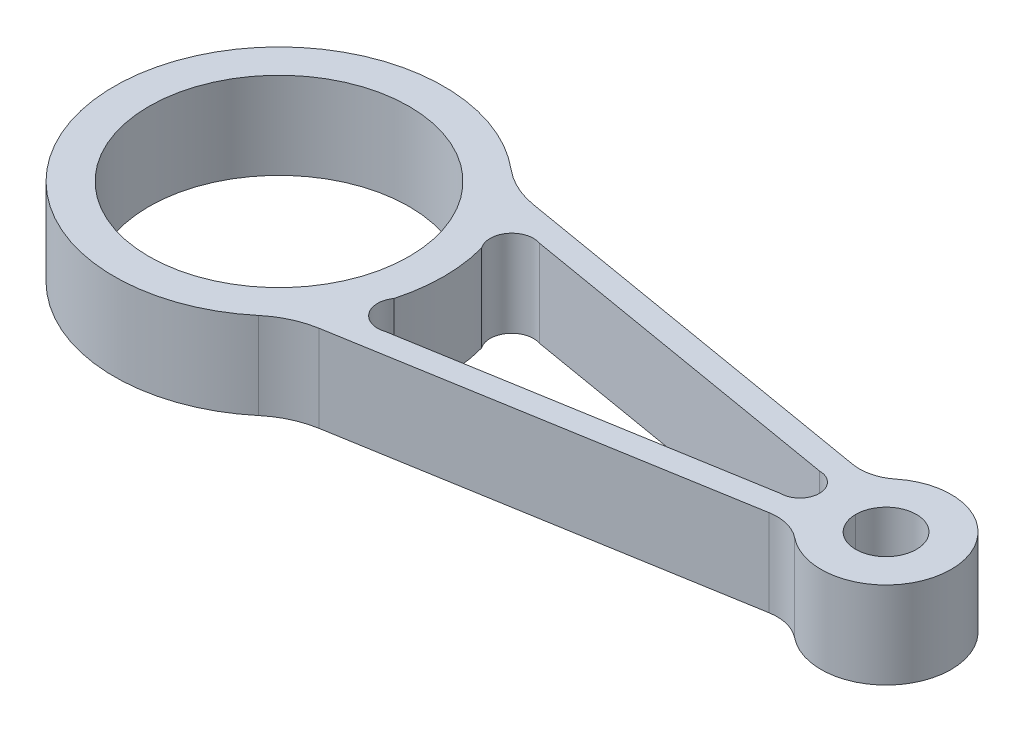
ISO-10303-21;
HEADER;
FILE_DESCRIPTION(('STEP AP214'),'2;1');
FILE_NAME('part.step','',(''),(''),'','','');
FILE_SCHEMA(('AUTOMOTIVE_DESIGN { 1 0 10303 214 1 1 1 1 }'));
ENDSEC;
DATA;
#1=APPLICATION_CONTEXT('core data for automotive mechanical design processes');
#2=APPLICATION_PROTOCOL_DEFINITION('international standard','automotive_design',2000,#1);
#3=PRODUCT_CONTEXT('',#1,'mechanical');
#4=PRODUCT('Part','Part','',(#3));
#5=PRODUCT_RELATED_PRODUCT_CATEGORY('part','',(#4));
#6=PRODUCT_DEFINITION_FORMATION('','',#4);
#7=PRODUCT_DEFINITION_CONTEXT('part definition',#1,'design');
#8=PRODUCT_DEFINITION('design','',#6,#7);
#9=PRODUCT_DEFINITION_SHAPE('','',#8);
#10=(LENGTH_UNIT() NAMED_UNIT(*) SI_UNIT(.MILLI.,.METRE.));
#11=(NAMED_UNIT(*) PLANE_ANGLE_UNIT() SI_UNIT($,.RADIAN.));
#12=(NAMED_UNIT(*) SI_UNIT($,.STERADIAN.) SOLID_ANGLE_UNIT());
#13=UNCERTAINTY_MEASURE_WITH_UNIT(LENGTH_MEASURE(1.E-05),#10,'distance_accuracy_value','');
#14=(GEOMETRIC_REPRESENTATION_CONTEXT(3) GLOBAL_UNCERTAINTY_ASSIGNED_CONTEXT((#13)) GLOBAL_UNIT_ASSIGNED_CONTEXT((#10,
#11,#12)) REPRESENTATION_CONTEXT('',''));
#15=CARTESIAN_POINT('',(0.,0.,0.));
#16=DIRECTION('',(0.,0.,1.));
#17=DIRECTION('',(1.,0.,0.));
#18=AXIS2_PLACEMENT_3D('',#15,#16,#17);
#19=CARTESIAN_POINT('',(21.2496463802184,10.,-4.8836400556848));
#20=DIRECTION('',(0.,-1.,0.));
#21=DIRECTION('',(0.,0.,-1.));
#22=AXIS2_PLACEMENT_3D('',#19,#20,#21);
#23=CYLINDRICAL_SURFACE('',#22,7.);
#24=CARTESIAN_POINT('',(21.2496463802184,10.,-4.8836400556848));
#25=DIRECTION('',(0.,1.,0.));
#26=DIRECTION('',(0.,0.,1.));
#27=AXIS2_PLACEMENT_3D('',#24,#25,#26);
#28=CIRCLE('',#27,7.);
#29=CARTESIAN_POINT('',(28.2496463802184,10.,-4.8836400556848));
#30=VERTEX_POINT('',#29);
#31=CARTESIAN_POINT('',(14.2496463802184,10.,-4.8836400556848));
#32=VERTEX_POINT('',#31);
#33=EDGE_CURVE('E216',#30,#32,#28,.T.);
#34=ORIENTED_EDGE('',*,*,#33,.T.);
#35=DIRECTION('',(0.,-1.,0.));
#36=VECTOR('',#35,1.);
#37=CARTESIAN_POINT('',(14.2496463802184,10.,-4.8836400556848));
#38=LINE('',#37,#36);
#39=CARTESIAN_POINT('',(14.2496463802184,-10.,-4.8836400556848));
#40=VERTEX_POINT('',#39);
#41=EDGE_CURVE('E11',#32,#40,#38,.T.);
#42=ORIENTED_EDGE('',*,*,#41,.T.);
#43=CARTESIAN_POINT('',(21.2496463802184,-10.,-4.8836400556848));
#44=DIRECTION('',(0.,1.,0.));
#45=DIRECTION('',(0.,0.,1.));
#46=AXIS2_PLACEMENT_3D('',#43,#44,#45);
#47=CIRCLE('',#46,7.);
#48=CARTESIAN_POINT('',(28.2496463802184,-10.,-4.8836400556848));
#49=VERTEX_POINT('',#48);
#50=EDGE_CURVE('E233',#49,#40,#47,.T.);
#51=ORIENTED_EDGE('',*,*,#50,.F.);
#52=DIRECTION('',(0.,1.,0.));
#53=VECTOR('',#52,1.);
#54=CARTESIAN_POINT('',(28.2496463802184,10.,-4.8836400556848));
#55=LINE('',#54,#53);
#56=EDGE_CURVE('E54',#49,#30,#55,.T.);
#57=ORIENTED_EDGE('',*,*,#56,.T.);
#58=EDGE_LOOP('',(#34,#42,#51,#57));
#59=FACE_BOUND('',#58,.T.);
#60=ADVANCED_FACE('F45',(#59),#23,.F.);
#61=CARTESIAN_POINT('',(2.50703369561259,10.,-14.7699727366896));
#62=DIRECTION('',(0.167344961591018,0.,-0.985898404416044));
#63=DIRECTION('',(-0.985898404416044,0.,-0.167344961591018));
#64=AXIS2_PLACEMENT_3D('',#61,#62,#63);
#65=PLANE('',#64);
#66=DIRECTION('',(0.985898404416044,0.,0.167344961591018));
#67=VECTOR('',#66,1.);
#68=CARTESIAN_POINT('',(2.50703369561259,-10.,-14.7699727366896));
#69=LINE('',#68,#67);
#70=CARTESIAN_POINT('',(-84.8092010521242,-10.,-29.5909034580322));
#71=VERTEX_POINT('',#70);
#72=CARTESIAN_POINT('',(3.93530449082066,-10.,-14.5275401287302));
#73=VERTEX_POINT('',#72);
#74=EDGE_CURVE('E236',#71,#73,#69,.T.);
#75=ORIENTED_EDGE('',*,*,#74,.F.);
#76=DIRECTION('',(0.,-1.,0.));
#77=VECTOR('',#76,1.);
#78=CARTESIAN_POINT('',(-84.8092010521243,10.,-29.5909034580322));
#79=LINE('',#78,#77);
#80=CARTESIAN_POINT('',(-84.8092010521242,10.,-29.5909034580322));
#81=VERTEX_POINT('',#80);
#82=EDGE_CURVE('E274',#71,#81,#79,.F.);
#83=ORIENTED_EDGE('',*,*,#82,.T.);
#84=DIRECTION('',(0.985898404416044,0.,0.167344961591018));
#85=VECTOR('',#84,1.);
#86=CARTESIAN_POINT('',(2.50703369561259,10.,-14.7699727366896));
#87=LINE('',#86,#85);
#88=CARTESIAN_POINT('',(3.93530449082066,10.,-14.5275401287302));
#89=VERTEX_POINT('',#88);
#90=EDGE_CURVE('E218',#81,#89,#87,.T.);
#91=ORIENTED_EDGE('',*,*,#90,.T.);
#92=DIRECTION('',(0.,-1.,0.));
#93=VECTOR('',#92,1.);
#94=CARTESIAN_POINT('',(3.93530449082067,10.,-14.5275401287302));
#95=LINE('',#94,#93);
#96=EDGE_CURVE('E256',#89,#73,#95,.T.);
#97=ORIENTED_EDGE('',*,*,#96,.T.);
#98=EDGE_LOOP('',(#75,#83,#91,#97));
#99=FACE_BOUND('',#98,.T.);
#100=ADVANCED_FACE('F312',(#99),#65,.T.);
#101=CARTESIAN_POINT('',(-118.750353619782,10.,-4.8836400556848));
#102=DIRECTION('',(0.,-1.,0.));
#103=DIRECTION('',(0.,0.,-1.));
#104=AXIS2_PLACEMENT_3D('',#101,#102,#103);
#105=CYLINDRICAL_SURFACE('',#104,38.);
#106=CARTESIAN_POINT('',(-118.750353619782,10.,-4.8836400556848));
#107=DIRECTION('',(0.,1.,0.));
#108=DIRECTION('',(0.,0.,1.));
#109=AXIS2_PLACEMENT_3D('',#106,#107,#108);
#110=CIRCLE('',#109,38.);
#111=CARTESIAN_POINT('',(-94.3202507166755,10.,-33.9898262047433));
#112=VERTEX_POINT('',#111);
#113=CARTESIAN_POINT('',(-94.3202507166755,10.,24.2225460933737));
#114=VERTEX_POINT('',#113);
#115=EDGE_CURVE('E221',#112,#114,#110,.T.);
#116=ORIENTED_EDGE('',*,*,#115,.F.);
#117=DIRECTION('',(0.,-1.,0.));
#118=VECTOR('',#117,1.);
#119=CARTESIAN_POINT('',(-94.3202507166755,10.,-33.9898262047433));
#120=LINE('',#119,#118);
#121=CARTESIAN_POINT('',(-94.3202507166755,-10.,-33.9898262047433));
#122=VERTEX_POINT('',#121);
#123=EDGE_CURVE('E271',#112,#122,#120,.T.);
#124=ORIENTED_EDGE('',*,*,#123,.T.);
#125=CARTESIAN_POINT('',(-118.750353619782,-10.,-4.8836400556848));
#126=DIRECTION('',(0.,1.,0.));
#127=DIRECTION('',(0.,0.,1.));
#128=AXIS2_PLACEMENT_3D('',#125,#126,#127);
#129=CIRCLE('',#128,38.);
#130=CARTESIAN_POINT('',(-94.3202507166755,-10.,24.2225460933737));
#131=VERTEX_POINT('',#130);
#132=EDGE_CURVE('E238',#122,#131,#129,.T.);
#133=ORIENTED_EDGE('',*,*,#132,.T.);
#134=DIRECTION('',(0.,-1.,0.));
#135=VECTOR('',#134,1.);
#136=CARTESIAN_POINT('',(-94.3202507166755,10.,24.2225460933737));
#137=LINE('',#136,#135);
#138=EDGE_CURVE('E269',#131,#114,#137,.F.);
#139=ORIENTED_EDGE('',*,*,#138,.T.);
#140=EDGE_LOOP('',(#116,#124,#133,#139));
#141=FACE_BOUND('',#140,.T.);
#142=ADVANCED_FACE('F316',(#141),#105,.T.);
#143=CARTESIAN_POINT('',(0.895577710639579,10.,5.27621882102439));
#144=DIRECTION('',(-0.167344961591018,0.,-0.985898404416044));
#145=DIRECTION('',(-0.985898404416044,0.,0.167344961591018));
#146=AXIS2_PLACEMENT_3D('',#143,#144,#145);
#147=PLANE('',#146);
#148=DIRECTION('',(0.985898404416044,0.,-0.167344961591018));
#149=VECTOR('',#148,1.);
#150=CARTESIAN_POINT('',(0.895577710639579,10.,5.27621882102439));
#151=LINE('',#150,#149);
#152=CARTESIAN_POINT('',(-84.8092010521242,10.,19.8236233466626));
#153=VERTEX_POINT('',#152);
#154=CARTESIAN_POINT('',(3.93530449082067,10.,4.76026001736055));
#155=VERTEX_POINT('',#154);
#156=EDGE_CURVE('E224',#153,#155,#151,.T.);
#157=ORIENTED_EDGE('',*,*,#156,.F.);
#158=DIRECTION('',(0.,1.,0.));
#159=VECTOR('',#158,1.);
#160=CARTESIAN_POINT('',(-84.8092010521242,-10.,19.8236233466626));
#161=LINE('',#160,#159);
#162=CARTESIAN_POINT('',(-84.8092010521242,-10.,19.8236233466626));
#163=VERTEX_POINT('',#162);
#164=EDGE_CURVE('E276',#153,#163,#161,.F.);
#165=ORIENTED_EDGE('',*,*,#164,.T.);
#166=DIRECTION('',(0.985898404416044,0.,-0.167344961591018));
#167=VECTOR('',#166,1.);
#168=CARTESIAN_POINT('',(0.895577710639579,-10.,5.27621882102439));
#169=LINE('',#168,#167);
#170=CARTESIAN_POINT('',(3.93530449082067,-10.,4.76026001736055));
#171=VERTEX_POINT('',#170);
#172=EDGE_CURVE('E241',#163,#171,#169,.T.);
#173=ORIENTED_EDGE('',*,*,#172,.T.);
#174=DIRECTION('',(0.,1.,0.));
#175=VECTOR('',#174,1.);
#176=CARTESIAN_POINT('',(3.93530449082067,10.,4.76026001736055));
#177=LINE('',#176,#175);
#178=EDGE_CURVE('E253',#171,#155,#177,.T.);
#179=ORIENTED_EDGE('',*,*,#178,.T.);
#180=EDGE_LOOP('',(#157,#165,#173,#179));
#181=FACE_BOUND('',#180,.T.);
#182=ADVANCED_FACE('F306',(#181),#147,.F.);
#183=CARTESIAN_POINT('',(21.2496463802184,10.,-4.8836400556848));
#184=DIRECTION('',(0.,-1.,0.));
#185=DIRECTION('',(0.,0.,-1.));
#186=AXIS2_PLACEMENT_3D('',#183,#184,#185);
#187=CYLINDRICAL_SURFACE('',#186,15.);
#188=CARTESIAN_POINT('',(21.2496463802184,10.,-4.8836400556848));
#189=DIRECTION('',(0.,1.,0.));
#190=DIRECTION('',(0.,0.,1.));
#191=AXIS2_PLACEMENT_3D('',#188,#189,#190);
#192=CIRCLE('',#191,15.);
#193=CARTESIAN_POINT('',(11.8651110161259,10.,6.81809041463867));
#194=VERTEX_POINT('',#193);
#195=CARTESIAN_POINT('',(11.8651110161259,10.,-16.5853705260083));
#196=VERTEX_POINT('',#195);
#197=EDGE_CURVE('E226',#194,#196,#192,.T.);
#198=ORIENTED_EDGE('',*,*,#197,.F.);
#199=DIRECTION('',(0.,-1.,0.));
#200=VECTOR('',#199,1.);
#201=CARTESIAN_POINT('',(11.8651110161259,10.,6.81809041463867));
#202=LINE('',#201,#200);
#203=CARTESIAN_POINT('',(11.8651110161259,-10.,6.81809041463867));
#204=VERTEX_POINT('',#203);
#205=EDGE_CURVE('E250',#194,#204,#202,.T.);
#206=ORIENTED_EDGE('',*,*,#205,.T.);
#207=CARTESIAN_POINT('',(21.2496463802184,-10.,-4.8836400556848));
#208=DIRECTION('',(0.,1.,0.));
#209=DIRECTION('',(0.,0.,1.));
#210=AXIS2_PLACEMENT_3D('',#207,#208,#209);
#211=CIRCLE('',#210,15.);
#212=CARTESIAN_POINT('',(11.8651110161259,-10.,-16.5853705260083));
#213=VERTEX_POINT('',#212);
#214=EDGE_CURVE('E243',#204,#213,#211,.T.);
#215=ORIENTED_EDGE('',*,*,#214,.T.);
#216=DIRECTION('',(0.,-1.,0.));
#217=VECTOR('',#216,1.);
#218=CARTESIAN_POINT('',(11.8651110161259,10.,-16.5853705260083));
#219=LINE('',#218,#217);
#220=EDGE_CURVE('E232',#213,#196,#219,.F.);
#221=ORIENTED_EDGE('',*,*,#220,.T.);
#222=EDGE_LOOP('',(#198,#206,#215,#221));
#223=FACE_BOUND('',#222,.T.);
#224=ADVANCED_FACE('F298',(#223),#187,.T.);
#225=ORIENTED_EDGE('',*,*,#41,.F.);
#226=EDGE_CURVE('E219',#32,#30,#28,.T.);
#227=ORIENTED_EDGE('',*,*,#226,.T.);
#228=ORIENTED_EDGE('',*,*,#56,.F.);
#229=EDGE_CURVE('E208',#40,#49,#47,.T.);
#230=ORIENTED_EDGE('',*,*,#229,.F.);
#231=EDGE_LOOP('',(#225,#227,#228,#230));
#232=FACE_BOUND('',#231,.T.);
#233=ADVANCED_FACE('F295',(#232),#23,.F.);
#234=CARTESIAN_POINT('',(-118.750353619782,10.,-4.8836400556848));
#235=DIRECTION('',(0.,-1.,0.));
#236=DIRECTION('',(0.,0.,-1.));
#237=AXIS2_PLACEMENT_3D('',#234,#235,#236);
#238=CYLINDRICAL_SURFACE('',#237,30.);
#239=CARTESIAN_POINT('',(-118.750353619782,10.,-4.8836400556848));
#240=DIRECTION('',(0.,1.,0.));
#241=DIRECTION('',(0.,0.,1.));
#242=AXIS2_PLACEMENT_3D('',#239,#240,#241);
#243=CIRCLE('',#242,30.);
#244=CARTESIAN_POINT('',(-118.750353619782,10.,25.1163599443152));
#245=VERTEX_POINT('',#244);
#246=EDGE_CURVE('E229',#245,#245,#243,.T.);
#247=ORIENTED_EDGE('',*,*,#246,.T.);
#248=EDGE_LOOP('',(#247));
#249=FACE_BOUND('',#248,.T.);
#250=CARTESIAN_POINT('',(-118.750353619782,-10.,-4.8836400556848));
#251=DIRECTION('',(0.,1.,0.));
#252=DIRECTION('',(0.,0.,1.));
#253=AXIS2_PLACEMENT_3D('',#250,#251,#252);
#254=CIRCLE('',#253,30.);
#255=CARTESIAN_POINT('',(-118.750353619782,-10.,25.1163599443152));
#256=VERTEX_POINT('',#255);
#257=EDGE_CURVE('E246',#256,#256,#254,.T.);
#258=ORIENTED_EDGE('',*,*,#257,.F.);
#259=EDGE_LOOP('',(#258));
#260=FACE_BOUND('',#259,.T.);
#261=ADVANCED_FACE('F297',(#249,#260),#238,.F.);
#262=CARTESIAN_POINT('',(0.,10.,0.));
#263=DIRECTION('',(0.,1.,0.));
#264=DIRECTION('',(0.,0.,1.));
#265=AXIS2_PLACEMENT_3D('',#262,#263,#264);
#266=PLANE('',#265);
#267=CARTESIAN_POINT('',(1.37390603918051,10.,-4.8836400556848));
#268=DIRECTION('',(0.,1.,0.));
#269=DIRECTION('',(0.,0.,1.));
#270=AXIS2_PLACEMENT_3D('',#267,#268,#269);
#271=CIRCLE('',#270,4.5);
#272=CARTESIAN_POINT('',(1.37390603918051,10.,-0.3836400556848));
#273=VERTEX_POINT('',#272);
#274=CARTESIAN_POINT('',(1.37390603918051,10.,-9.3836400556848));
#275=VERTEX_POINT('',#274);
#276=EDGE_CURVE('E163',#273,#275,#271,.T.);
#277=ORIENTED_EDGE('',*,*,#276,.F.);
#278=DIRECTION('',(0.985898404416043,0.,-0.167344961591018));
#279=VECTOR('',#278,1.);
#280=CARTESIAN_POINT('',(-76.3856633438721,10.,12.8151561828065));
#281=LINE('',#280,#279);
#282=CARTESIAN_POINT('',(-76.3856633438721,10.,12.8151561828065));
#283=VERTEX_POINT('',#282);
#284=EDGE_CURVE('E182',#283,#273,#281,.T.);
#285=ORIENTED_EDGE('',*,*,#284,.F.);
#286=CARTESIAN_POINT('',(-78.0355146500686,10.,8.0951995445055));
#287=DIRECTION('',(0.,1.,0.));
#288=DIRECTION('',(0.,0.,1.));
#289=AXIS2_PLACEMENT_3D('',#286,#287,#288);
#290=CIRCLE('',#289,4.99999999999999);
#291=CARTESIAN_POINT('',(-82.1130798779666,10.,5.20150608937991));
#292=VERTEX_POINT('',#291);
#293=EDGE_CURVE('E185',#292,#283,#290,.T.);
#294=ORIENTED_EDGE('',*,*,#293,.F.);
#295=CARTESIAN_POINT('',(-118.750353619782,10.,-4.8836400556848));
#296=DIRECTION('',(0.,-1.,0.));
#297=DIRECTION('',(0.,0.,1.));
#298=AXIS2_PLACEMENT_3D('',#295,#296,#297);
#299=CIRCLE('',#298,38.);
#300=CARTESIAN_POINT('',(-82.1130798779666,10.,-14.9687862007495));
#301=VERTEX_POINT('',#300);
#302=EDGE_CURVE('E201',#301,#292,#299,.T.);
#303=ORIENTED_EDGE('',*,*,#302,.F.);
#304=CARTESIAN_POINT('',(-78.0355146500686,10.,-17.8624796558751));
#305=DIRECTION('',(0.,1.,0.));
#306=DIRECTION('',(0.,0.,1.));
#307=AXIS2_PLACEMENT_3D('',#304,#305,#306);
#308=CIRCLE('',#307,4.99999999999999);
#309=CARTESIAN_POINT('',(-76.3856633438721,10.,-22.5824362941761));
#310=VERTEX_POINT('',#309);
#311=EDGE_CURVE('E198',#310,#301,#308,.T.);
#312=ORIENTED_EDGE('',*,*,#311,.F.);
#313=DIRECTION('',(-0.985898404416043,0.,-0.167344961591018));
#314=VECTOR('',#313,1.);
#315=CARTESIAN_POINT('',(-76.3856633438721,10.,-22.5824362941761));
#316=LINE('',#315,#314);
#317=EDGE_CURVE('E196',#275,#310,#316,.T.);
#318=ORIENTED_EDGE('',*,*,#317,.F.);
#319=EDGE_LOOP('',(#277,#285,#294,#303,#312,#318));
#320=FACE_BOUND('',#319,.T.);
#321=ORIENTED_EDGE('',*,*,#33,.F.);
#322=ORIENTED_EDGE('',*,*,#226,.F.);
#323=EDGE_LOOP('',(#321,#322));
#324=FACE_BOUND('',#323,.T.);
#325=ORIENTED_EDGE('',*,*,#90,.F.);
#326=CARTESIAN_POINT('',(-81.4623018203039,10.,-49.3088715463531));
#327=DIRECTION('',(0.,1.,0.));
#328=DIRECTION('',(0.,0.,1.));
#329=AXIS2_PLACEMENT_3D('',#326,#327,#328);
#330=CIRCLE('',#329,20.);
#331=EDGE_CURVE('E281',#81,#112,#330,.F.);
#332=ORIENTED_EDGE('',*,*,#331,.T.);
#333=ORIENTED_EDGE('',*,*,#115,.T.);
#334=CARTESIAN_POINT('',(-81.4623018203039,10.,39.5415914349835));
#335=DIRECTION('',(0.,1.,0.));
#336=DIRECTION('',(0.,0.,1.));
#337=AXIS2_PLACEMENT_3D('',#334,#335,#336);
#338=CIRCLE('',#337,20.);
#339=EDGE_CURVE('E285',#114,#153,#338,.F.);
#340=ORIENTED_EDGE('',*,*,#339,.T.);
#341=ORIENTED_EDGE('',*,*,#156,.T.);
#342=CARTESIAN_POINT('',(5.60875410673085,10.,14.619244061521));
#343=DIRECTION('',(0.,1.,0.));
#344=DIRECTION('',(0.,0.,1.));
#345=AXIS2_PLACEMENT_3D('',#342,#343,#344);
#346=CIRCLE('',#345,10.);
#347=EDGE_CURVE('E262',#155,#194,#346,.F.);
#348=ORIENTED_EDGE('',*,*,#347,.T.);
#349=ORIENTED_EDGE('',*,*,#197,.T.);
#350=CARTESIAN_POINT('',(5.60875410673085,10.,-24.3865241728906));
#351=DIRECTION('',(0.,1.,0.));
#352=DIRECTION('',(0.,0.,1.));
#353=AXIS2_PLACEMENT_3D('',#350,#351,#352);
#354=CIRCLE('',#353,10.);
#355=EDGE_CURVE('E266',#196,#89,#354,.F.);
#356=ORIENTED_EDGE('',*,*,#355,.T.);
#357=EDGE_LOOP('',(#325,#332,#333,#340,#341,#348,#349,#356));
#358=FACE_BOUND('',#357,.T.);
#359=ORIENTED_EDGE('',*,*,#246,.F.);
#360=EDGE_LOOP('',(#359));
#361=FACE_BOUND('',#360,.T.);
#362=ADVANCED_FACE('F293',(#320,#324,#358,#361),#266,.T.);
#363=CARTESIAN_POINT('',(0.,-10.,0.));
#364=DIRECTION('',(0.,1.,0.));
#365=DIRECTION('',(0.,0.,1.));
#366=AXIS2_PLACEMENT_3D('',#363,#364,#365);
#367=PLANE('',#366);
#368=DIRECTION('',(0.985898404416043,0.,-0.167344961591018));
#369=VECTOR('',#368,1.);
#370=CARTESIAN_POINT('',(-76.3856633438721,-10.,12.8151561828065));
#371=LINE('',#370,#369);
#372=CARTESIAN_POINT('',(-76.3856633438721,-10.,12.8151561828065));
#373=VERTEX_POINT('',#372);
#374=CARTESIAN_POINT('',(1.37390603918051,-10.,-0.3836400556848));
#375=VERTEX_POINT('',#374);
#376=EDGE_CURVE('E168',#373,#375,#371,.T.);
#377=ORIENTED_EDGE('',*,*,#376,.T.);
#378=CARTESIAN_POINT('',(1.37390603918051,-10.,-4.8836400556848));
#379=DIRECTION('',(0.,1.,0.));
#380=DIRECTION('',(0.,0.,1.));
#381=AXIS2_PLACEMENT_3D('',#378,#379,#380);
#382=CIRCLE('',#381,4.5);
#383=CARTESIAN_POINT('',(1.37390603918051,-10.,-9.3836400556848));
#384=VERTEX_POINT('',#383);
#385=EDGE_CURVE('E160',#375,#384,#382,.T.);
#386=ORIENTED_EDGE('',*,*,#385,.T.);
#387=DIRECTION('',(-0.985898404416043,0.,-0.167344961591018));
#388=VECTOR('',#387,1.);
#389=CARTESIAN_POINT('',(-76.3856633438721,-10.,-22.5824362941761));
#390=LINE('',#389,#388);
#391=CARTESIAN_POINT('',(-76.3856633438721,-10.,-22.5824362941761));
#392=VERTEX_POINT('',#391);
#393=EDGE_CURVE('E172',#384,#392,#390,.T.);
#394=ORIENTED_EDGE('',*,*,#393,.T.);
#395=CARTESIAN_POINT('',(-78.0355146500686,-10.,-17.8624796558751));
#396=DIRECTION('',(0.,1.,0.));
#397=DIRECTION('',(0.,0.,1.));
#398=AXIS2_PLACEMENT_3D('',#395,#396,#397);
#399=CIRCLE('',#398,4.99999999999999);
#400=CARTESIAN_POINT('',(-82.1130798779666,-10.,-14.9687862007495));
#401=VERTEX_POINT('',#400);
#402=EDGE_CURVE('E176',#392,#401,#399,.T.);
#403=ORIENTED_EDGE('',*,*,#402,.T.);
#404=CARTESIAN_POINT('',(-118.750353619782,-10.,-4.8836400556848));
#405=DIRECTION('',(0.,-1.,0.));
#406=DIRECTION('',(0.,0.,1.));
#407=AXIS2_PLACEMENT_3D('',#404,#405,#406);
#408=CIRCLE('',#407,38.);
#409=CARTESIAN_POINT('',(-82.1130798779666,-10.,5.20150608937991));
#410=VERTEX_POINT('',#409);
#411=EDGE_CURVE('E189',#401,#410,#408,.T.);
#412=ORIENTED_EDGE('',*,*,#411,.T.);
#413=CARTESIAN_POINT('',(-78.0355146500686,-10.,8.0951995445055));
#414=DIRECTION('',(0.,1.,0.));
#415=DIRECTION('',(0.,0.,1.));
#416=AXIS2_PLACEMENT_3D('',#413,#414,#415);
#417=CIRCLE('',#416,4.99999999999999);
#418=EDGE_CURVE('E192',#410,#373,#417,.T.);
#419=ORIENTED_EDGE('',*,*,#418,.T.);
#420=EDGE_LOOP('',(#377,#386,#394,#403,#412,#419));
#421=FACE_BOUND('',#420,.T.);
#422=ORIENTED_EDGE('',*,*,#50,.T.);
#423=ORIENTED_EDGE('',*,*,#229,.T.);
#424=EDGE_LOOP('',(#422,#423));
#425=FACE_BOUND('',#424,.T.);
#426=ORIENTED_EDGE('',*,*,#132,.F.);
#427=CARTESIAN_POINT('',(-81.4623018203039,-10.,-49.3088715463531));
#428=DIRECTION('',(0.,1.,0.));
#429=DIRECTION('',(0.,0.,1.));
#430=AXIS2_PLACEMENT_3D('',#427,#428,#429);
#431=CIRCLE('',#430,20.);
#432=EDGE_CURVE('E279',#122,#71,#431,.T.);
#433=ORIENTED_EDGE('',*,*,#432,.T.);
#434=ORIENTED_EDGE('',*,*,#74,.T.);
#435=CARTESIAN_POINT('',(5.60875410673085,-10.,-24.3865241728906));
#436=DIRECTION('',(0.,1.,0.));
#437=DIRECTION('',(0.,0.,1.));
#438=AXIS2_PLACEMENT_3D('',#435,#436,#437);
#439=CIRCLE('',#438,10.);
#440=EDGE_CURVE('E264',#73,#213,#439,.T.);
#441=ORIENTED_EDGE('',*,*,#440,.T.);
#442=ORIENTED_EDGE('',*,*,#214,.F.);
#443=CARTESIAN_POINT('',(5.60875410673085,-10.,14.619244061521));
#444=DIRECTION('',(0.,1.,0.));
#445=DIRECTION('',(0.,0.,1.));
#446=AXIS2_PLACEMENT_3D('',#443,#444,#445);
#447=CIRCLE('',#446,10.);
#448=EDGE_CURVE('E259',#204,#171,#447,.T.);
#449=ORIENTED_EDGE('',*,*,#448,.T.);
#450=ORIENTED_EDGE('',*,*,#172,.F.);
#451=CARTESIAN_POINT('',(-81.4623018203039,-10.,39.5415914349835));
#452=DIRECTION('',(0.,1.,0.));
#453=DIRECTION('',(0.,0.,1.));
#454=AXIS2_PLACEMENT_3D('',#451,#452,#453);
#455=CIRCLE('',#454,20.);
#456=EDGE_CURVE('E283',#163,#131,#455,.T.);
#457=ORIENTED_EDGE('',*,*,#456,.T.);
#458=EDGE_LOOP('',(#426,#433,#434,#441,#442,#449,#450,#457));
#459=FACE_BOUND('',#458,.T.);
#460=ORIENTED_EDGE('',*,*,#257,.T.);
#461=EDGE_LOOP('',(#460));
#462=FACE_BOUND('',#461,.T.);
#463=ADVANCED_FACE('F178',(#421,#425,#459,#462),#367,.F.);
#464=CARTESIAN_POINT('',(5.60875410673085,10.,14.619244061521));
#465=DIRECTION('',(0.,-1.,0.));
#466=DIRECTION('',(0.,0.,-1.));
#467=AXIS2_PLACEMENT_3D('',#464,#465,#466);
#468=CYLINDRICAL_SURFACE('',#467,10.);
#469=ORIENTED_EDGE('',*,*,#347,.F.);
#470=ORIENTED_EDGE('',*,*,#178,.F.);
#471=ORIENTED_EDGE('',*,*,#448,.F.);
#472=ORIENTED_EDGE('',*,*,#205,.F.);
#473=EDGE_LOOP('',(#469,#470,#471,#472));
#474=FACE_BOUND('',#473,.T.);
#475=ADVANCED_FACE('F330',(#474),#468,.F.);
#476=CARTESIAN_POINT('',(5.60875410673085,10.,-24.3865241728906));
#477=DIRECTION('',(0.,-1.,0.));
#478=DIRECTION('',(0.,0.,-1.));
#479=AXIS2_PLACEMENT_3D('',#476,#477,#478);
#480=CYLINDRICAL_SURFACE('',#479,10.);
#481=ORIENTED_EDGE('',*,*,#355,.F.);
#482=ORIENTED_EDGE('',*,*,#220,.F.);
#483=ORIENTED_EDGE('',*,*,#440,.F.);
#484=ORIENTED_EDGE('',*,*,#96,.F.);
#485=EDGE_LOOP('',(#481,#482,#483,#484));
#486=FACE_BOUND('',#485,.T.);
#487=ADVANCED_FACE('F416',(#486),#480,.F.);
#488=CARTESIAN_POINT('',(-81.4623018203039,10.,-49.3088715463531));
#489=DIRECTION('',(0.,-1.,0.));
#490=DIRECTION('',(0.,0.,-1.));
#491=AXIS2_PLACEMENT_3D('',#488,#489,#490);
#492=CYLINDRICAL_SURFACE('',#491,20.);
#493=ORIENTED_EDGE('',*,*,#331,.F.);
#494=ORIENTED_EDGE('',*,*,#82,.F.);
#495=ORIENTED_EDGE('',*,*,#432,.F.);
#496=ORIENTED_EDGE('',*,*,#123,.F.);
#497=EDGE_LOOP('',(#493,#494,#495,#496));
#498=FACE_BOUND('',#497,.T.);
#499=ADVANCED_FACE('F423',(#498),#492,.F.);
#500=CARTESIAN_POINT('',(-81.4623018203039,10.,39.5415914349835));
#501=DIRECTION('',(0.,-1.,0.));
#502=DIRECTION('',(0.,0.,-1.));
#503=AXIS2_PLACEMENT_3D('',#500,#501,#502);
#504=CYLINDRICAL_SURFACE('',#503,20.);
#505=ORIENTED_EDGE('',*,*,#339,.F.);
#506=ORIENTED_EDGE('',*,*,#138,.F.);
#507=ORIENTED_EDGE('',*,*,#456,.F.);
#508=ORIENTED_EDGE('',*,*,#164,.F.);
#509=EDGE_LOOP('',(#505,#506,#507,#508));
#510=FACE_BOUND('',#509,.T.);
#511=ADVANCED_FACE('F47',(#510),#504,.F.);
#512=CARTESIAN_POINT('',(1.37390603918051,-10.,-4.8836400556848));
#513=DIRECTION('',(0.,1.,0.));
#514=DIRECTION('',(0.,0.,1.));
#515=AXIS2_PLACEMENT_3D('',#512,#513,#514);
#516=CYLINDRICAL_SURFACE('',#515,4.5);
#517=ORIENTED_EDGE('',*,*,#276,.T.);
#518=DIRECTION('',(0.,1.,0.));
#519=VECTOR('',#518,1.);
#520=CARTESIAN_POINT('',(1.37390603918051,-10.,-9.3836400556848));
#521=LINE('',#520,#519);
#522=EDGE_CURVE('E156',#384,#275,#521,.T.);
#523=ORIENTED_EDGE('',*,*,#522,.F.);
#524=ORIENTED_EDGE('',*,*,#385,.F.);
#525=DIRECTION('',(0.,1.,0.));
#526=VECTOR('',#525,1.);
#527=CARTESIAN_POINT('',(1.37390603918051,-10.,-0.3836400556848));
#528=LINE('',#527,#526);
#529=EDGE_CURVE('E206',#375,#273,#528,.T.);
#530=ORIENTED_EDGE('',*,*,#529,.T.);
#531=EDGE_LOOP('',(#517,#523,#524,#530));
#532=FACE_BOUND('',#531,.T.);
#533=ADVANCED_FACE('F158',(#532),#516,.F.);
#534=CARTESIAN_POINT('',(-76.3856633438721,-10.,12.8151561828065));
#535=DIRECTION('',(0.167344961591018,0.,0.985898404416044));
#536=DIRECTION('',(0.985898404416044,0.,-0.167344961591018));
#537=AXIS2_PLACEMENT_3D('',#534,#535,#536);
#538=PLANE('',#537);
#539=ORIENTED_EDGE('',*,*,#284,.T.);
#540=ORIENTED_EDGE('',*,*,#529,.F.);
#541=ORIENTED_EDGE('',*,*,#376,.F.);
#542=DIRECTION('',(0.,1.,0.));
#543=VECTOR('',#542,1.);
#544=CARTESIAN_POINT('',(-76.3856633438721,-10.,12.8151561828065));
#545=LINE('',#544,#543);
#546=EDGE_CURVE('E209',#373,#283,#545,.T.);
#547=ORIENTED_EDGE('',*,*,#546,.T.);
#548=EDGE_LOOP('',(#539,#540,#541,#547));
#549=FACE_BOUND('',#548,.T.);
#550=ADVANCED_FACE('F336',(#549),#538,.F.);
#551=CARTESIAN_POINT('',(-78.0355146500686,-10.,8.0951995445055));
#552=DIRECTION('',(0.,1.,0.));
#553=DIRECTION('',(0.,0.,1.));
#554=AXIS2_PLACEMENT_3D('',#551,#552,#553);
#555=CYLINDRICAL_SURFACE('',#554,4.99999999999999);
#556=ORIENTED_EDGE('',*,*,#293,.T.);
#557=ORIENTED_EDGE('',*,*,#546,.F.);
#558=ORIENTED_EDGE('',*,*,#418,.F.);
#559=DIRECTION('',(0.,1.,0.));
#560=VECTOR('',#559,1.);
#561=CARTESIAN_POINT('',(-82.1130798779666,-10.,5.20150608937991));
#562=LINE('',#561,#560);
#563=EDGE_CURVE('E211',#410,#292,#562,.T.);
#564=ORIENTED_EDGE('',*,*,#563,.T.);
#565=EDGE_LOOP('',(#556,#557,#558,#564));
#566=FACE_BOUND('',#565,.T.);
#567=ADVANCED_FACE('F346',(#566),#555,.F.);
#568=CARTESIAN_POINT('',(-118.750353619782,-10.,-4.8836400556848));
#569=DIRECTION('',(0.,1.,0.));
#570=DIRECTION('',(0.,0.,1.));
#571=AXIS2_PLACEMENT_3D('',#568,#569,#570);
#572=CYLINDRICAL_SURFACE('',#571,38.);
#573=ORIENTED_EDGE('',*,*,#302,.T.);
#574=ORIENTED_EDGE('',*,*,#563,.F.);
#575=ORIENTED_EDGE('',*,*,#411,.F.);
#576=DIRECTION('',(0.,1.,0.));
#577=VECTOR('',#576,1.);
#578=CARTESIAN_POINT('',(-82.1130798779666,-10.,-14.9687862007495));
#579=LINE('',#578,#577);
#580=EDGE_CURVE('E213',#401,#301,#579,.T.);
#581=ORIENTED_EDGE('',*,*,#580,.T.);
#582=EDGE_LOOP('',(#573,#574,#575,#581));
#583=FACE_BOUND('',#582,.T.);
#584=ADVANCED_FACE('F342',(#583),#572,.T.);
#585=CARTESIAN_POINT('',(-78.0355146500686,-10.,-17.8624796558751));
#586=DIRECTION('',(0.,1.,0.));
#587=DIRECTION('',(0.,0.,1.));
#588=AXIS2_PLACEMENT_3D('',#585,#586,#587);
#589=CYLINDRICAL_SURFACE('',#588,4.99999999999999);
#590=ORIENTED_EDGE('',*,*,#311,.T.);
#591=ORIENTED_EDGE('',*,*,#580,.F.);
#592=ORIENTED_EDGE('',*,*,#402,.F.);
#593=DIRECTION('',(0.,1.,0.));
#594=VECTOR('',#593,1.);
#595=CARTESIAN_POINT('',(-76.3856633438721,-10.,-22.5824362941761));
#596=LINE('',#595,#594);
#597=EDGE_CURVE('E167',#392,#310,#596,.T.);
#598=ORIENTED_EDGE('',*,*,#597,.T.);
#599=EDGE_LOOP('',(#590,#591,#592,#598));
#600=FACE_BOUND('',#599,.T.);
#601=ADVANCED_FACE('F339',(#600),#589,.F.);
#602=CARTESIAN_POINT('',(-76.3856633438721,-10.,-22.5824362941761));
#603=DIRECTION('',(0.167344961591018,0.,-0.985898404416043));
#604=DIRECTION('',(-0.985898404416044,0.,-0.167344961591018));
#605=AXIS2_PLACEMENT_3D('',#602,#603,#604);
#606=PLANE('',#605);
#607=ORIENTED_EDGE('',*,*,#317,.T.);
#608=ORIENTED_EDGE('',*,*,#597,.F.);
#609=ORIENTED_EDGE('',*,*,#393,.F.);
#610=ORIENTED_EDGE('',*,*,#522,.T.);
#611=EDGE_LOOP('',(#607,#608,#609,#610));
#612=FACE_BOUND('',#611,.T.);
#613=ADVANCED_FACE('F173',(#612),#606,.F.);
#614=CLOSED_SHELL('',(#60,#100,#142,#182,#224,#233,#261,#362,#463,#475,#487,#499,#511,#533,#550,
#567,#584,#601,#613));
#615=MANIFOLD_SOLID_BREP('B2',#614);
#616=ADVANCED_BREP_SHAPE_REPRESENTATION('',(#18,#615),#14);
#617=SHAPE_DEFINITION_REPRESENTATION(#9,#616);
ENDSEC;
END-ISO-10303-21;
